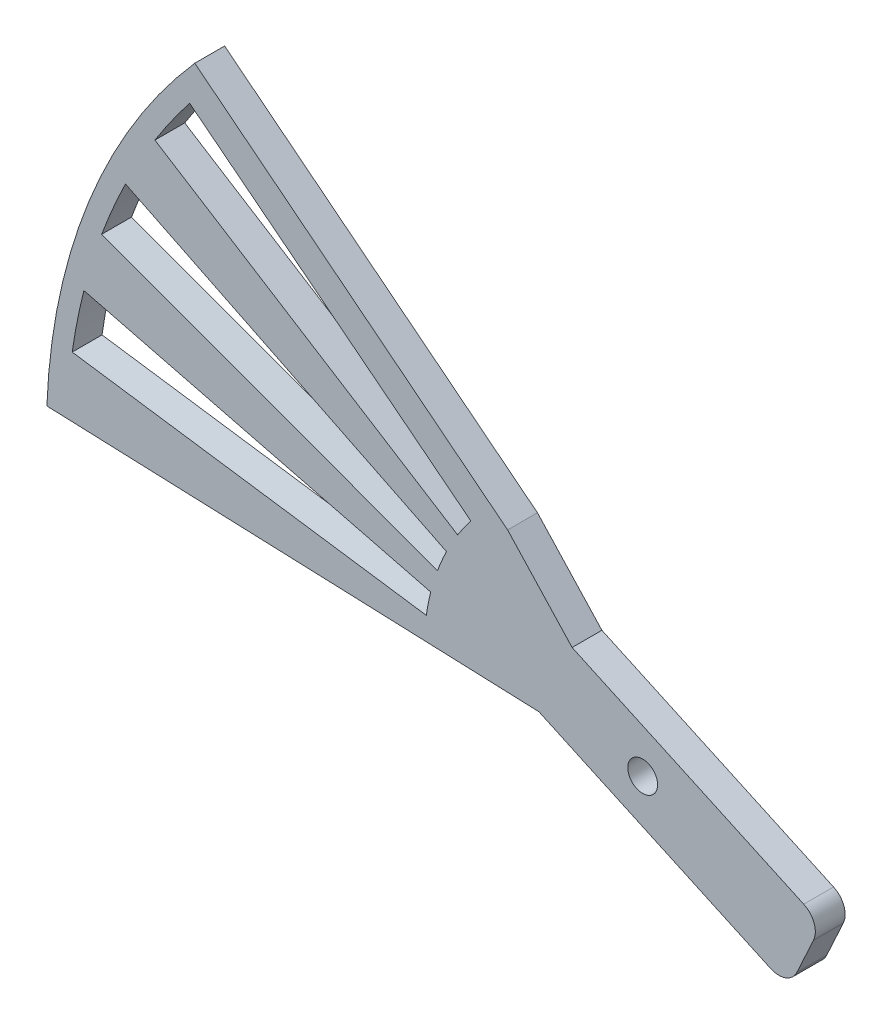
ISO-10303-21;
HEADER;
FILE_DESCRIPTION(('STEP AP214'),'2;1');
FILE_NAME('part.step','',(''),(''),'','','');
FILE_SCHEMA(('AUTOMOTIVE_DESIGN { 1 0 10303 214 1 1 1 1 }'));
ENDSEC;
DATA;
#1=APPLICATION_CONTEXT('core data for automotive mechanical design processes');
#2=APPLICATION_PROTOCOL_DEFINITION('international standard','automotive_design',2000,#1);
#3=PRODUCT_CONTEXT('',#1,'mechanical');
#4=PRODUCT('Part','Part','',(#3));
#5=PRODUCT_RELATED_PRODUCT_CATEGORY('part','',(#4));
#6=PRODUCT_DEFINITION_FORMATION('','',#4);
#7=PRODUCT_DEFINITION_CONTEXT('part definition',#1,'design');
#8=PRODUCT_DEFINITION('design','',#6,#7);
#9=PRODUCT_DEFINITION_SHAPE('','',#8);
#10=(LENGTH_UNIT() NAMED_UNIT(*) SI_UNIT(.MILLI.,.METRE.));
#11=(NAMED_UNIT(*) PLANE_ANGLE_UNIT() SI_UNIT($,.RADIAN.));
#12=(NAMED_UNIT(*) SI_UNIT($,.STERADIAN.) SOLID_ANGLE_UNIT());
#13=UNCERTAINTY_MEASURE_WITH_UNIT(LENGTH_MEASURE(1.E-05),#10,'distance_accuracy_value','');
#14=(GEOMETRIC_REPRESENTATION_CONTEXT(3) GLOBAL_UNCERTAINTY_ASSIGNED_CONTEXT((#13)) GLOBAL_UNIT_ASSIGNED_CONTEXT((#10,
#11,#12)) REPRESENTATION_CONTEXT('',''));
#15=CARTESIAN_POINT('',(0.,0.,0.));
#16=DIRECTION('',(0.,0.,1.));
#17=DIRECTION('',(1.,0.,0.));
#18=AXIS2_PLACEMENT_3D('',#15,#16,#17);
#19=CARTESIAN_POINT('',(-13.592462365831,14.671229220262,3.));
#20=DIRECTION('',(-0.620836450086055,-0.783940113940182,0.));
#21=DIRECTION('',(0.783940113940182,-0.620836450086055,0.));
#22=AXIS2_PLACEMENT_3D('',#19,#20,#21);
#23=PLANE('',#22);
#24=DIRECTION('',(-0.783940113940182,0.620836450086055,0.));
#25=VECTOR('',#24,1.);
#26=CARTESIAN_POINT('',(-13.592462365831,14.671229220262,0.));
#27=LINE('',#26,#25);
#28=CARTESIAN_POINT('',(-13.592462365831,14.671229220262,0.));
#29=VERTEX_POINT('',#28);
#30=CARTESIAN_POINT('',(-45.0736727010104,39.6025760430074,0.));
#31=VERTEX_POINT('',#30);
#32=EDGE_CURVE('E370',#29,#31,#27,.T.);
#33=ORIENTED_EDGE('',*,*,#32,.T.);
#34=DIRECTION('',(0.,0.,-1.));
#35=VECTOR('',#34,1.);
#36=CARTESIAN_POINT('',(-45.0736727010104,39.6025760430074,3.));
#37=LINE('',#36,#35);
#38=CARTESIAN_POINT('',(-45.0736727010104,39.6025760430074,3.));
#39=VERTEX_POINT('',#38);
#40=EDGE_CURVE('E391',#39,#31,#37,.T.);
#41=ORIENTED_EDGE('',*,*,#40,.F.);
#42=DIRECTION('',(-0.783940113940182,0.620836450086055,0.));
#43=VECTOR('',#42,1.);
#44=CARTESIAN_POINT('',(-13.592462365831,14.671229220262,3.));
#45=LINE('',#44,#43);
#46=CARTESIAN_POINT('',(-13.592462365831,14.671229220262,3.));
#47=VERTEX_POINT('',#46);
#48=EDGE_CURVE('E373',#47,#39,#45,.T.);
#49=ORIENTED_EDGE('',*,*,#48,.F.);
#50=DIRECTION('',(0.,0.,-1.));
#51=VECTOR('',#50,1.);
#52=CARTESIAN_POINT('',(-13.592462365831,14.671229220262,3.));
#53=LINE('',#52,#51);
#54=EDGE_CURVE('E386',#47,#29,#53,.T.);
#55=ORIENTED_EDGE('',*,*,#54,.T.);
#56=EDGE_LOOP('',(#33,#41,#49,#55));
#57=FACE_BOUND('',#56,.T.);
#58=ADVANCED_FACE('F42',(#57),#23,.F.);
#59=CARTESIAN_POINT('',(0.,0.,3.));
#60=DIRECTION('',(0.,0.,-1.));
#61=DIRECTION('',(-1.,0.,0.));
#62=AXIS2_PLACEMENT_3D('',#59,#60,#61);
#63=CYLINDRICAL_SURFACE('',#62,60.);
#64=CARTESIAN_POINT('',(0.,0.,0.));
#65=DIRECTION('',(0.,0.,1.));
#66=DIRECTION('',(1.,0.,0.));
#67=AXIS2_PLACEMENT_3D('',#64,#65,#66);
#68=CIRCLE('',#67,60.);
#69=CARTESIAN_POINT('',(-59.9563439456744,2.28841007426227,0.));
#70=VERTEX_POINT('',#69);
#71=EDGE_CURVE('E380',#31,#70,#68,.T.);
#72=ORIENTED_EDGE('',*,*,#71,.T.);
#73=DIRECTION('',(0.,0.,-1.));
#74=VECTOR('',#73,1.);
#75=CARTESIAN_POINT('',(-59.9563439456744,2.28841007426227,3.));
#76=LINE('',#75,#74);
#77=CARTESIAN_POINT('',(-59.9563439456744,2.28841007426227,3.));
#78=VERTEX_POINT('',#77);
#79=EDGE_CURVE('E376',#78,#70,#76,.T.);
#80=ORIENTED_EDGE('',*,*,#79,.F.);
#81=CARTESIAN_POINT('',(0.,0.,3.));
#82=DIRECTION('',(0.,0.,1.));
#83=DIRECTION('',(1.,0.,0.));
#84=AXIS2_PLACEMENT_3D('',#81,#82,#83);
#85=CIRCLE('',#84,60.);
#86=EDGE_CURVE('E369',#39,#78,#85,.T.);
#87=ORIENTED_EDGE('',*,*,#86,.F.);
#88=ORIENTED_EDGE('',*,*,#40,.T.);
#89=EDGE_LOOP('',(#72,#80,#87,#88));
#90=FACE_BOUND('',#89,.T.);
#91=ADVANCED_FACE('F451',(#90),#63,.T.);
#92=CARTESIAN_POINT('',(-19.9854479818915,0.762803358087425,3.));
#93=DIRECTION('',(-0.0381401679043713,-0.999272399094574,0.));
#94=DIRECTION('',(0.999272399094575,-0.0381401679043713,0.));
#95=AXIS2_PLACEMENT_3D('',#92,#93,#94);
#96=PLANE('',#95);
#97=DIRECTION('',(-0.999272399094574,0.0381401679043713,0.));
#98=VECTOR('',#97,1.);
#99=CARTESIAN_POINT('',(-19.9854479818915,0.762803358087425,0.));
#100=LINE('',#99,#98);
#101=CARTESIAN_POINT('',(-10.4448984678413,0.39866024686416,0.));
#102=VERTEX_POINT('',#101);
#103=EDGE_CURVE('E364',#102,#70,#100,.T.);
#104=ORIENTED_EDGE('',*,*,#103,.F.);
#105=DIRECTION('',(0.,0.,-1.));
#106=VECTOR('',#105,1.);
#107=CARTESIAN_POINT('',(-10.4448984678413,0.39866024686416,3.));
#108=LINE('',#107,#106);
#109=CARTESIAN_POINT('',(-10.4448984678413,0.39866024686416,3.));
#110=VERTEX_POINT('',#109);
#111=EDGE_CURVE('E360',#110,#102,#108,.T.);
#112=ORIENTED_EDGE('',*,*,#111,.F.);
#113=DIRECTION('',(-0.999272399094574,0.0381401679043713,0.));
#114=VECTOR('',#113,1.);
#115=CARTESIAN_POINT('',(-19.9854479818915,0.762803358087425,3.));
#116=LINE('',#115,#114);
#117=EDGE_CURVE('E365',#110,#78,#116,.T.);
#118=ORIENTED_EDGE('',*,*,#117,.T.);
#119=ORIENTED_EDGE('',*,*,#79,.T.);
#120=EDGE_LOOP('',(#104,#112,#118,#119));
#121=FACE_BOUND('',#120,.T.);
#122=ADVANCED_FACE('F446',(#121),#96,.T.);
#123=CARTESIAN_POINT('',(0.,0.,3.));
#124=DIRECTION('',(0.,0.,1.));
#125=DIRECTION('',(1.,0.,0.));
#126=AXIS2_PLACEMENT_3D('',#123,#124,#125);
#127=PLANE('',#126);
#128=CARTESIAN_POINT('',(0.,0.,3.));
#129=DIRECTION('',(0.,0.,-1.));
#130=DIRECTION('',(1.,0.,0.));
#131=AXIS2_PLACEMENT_3D('',#128,#129,#130);
#132=CIRCLE('',#131,22.);
#133=CARTESIAN_POINT('',(-20.6487284665645,7.59144338805803,3.));
#134=VERTEX_POINT('',#133);
#135=CARTESIAN_POINT('',(-19.7420906601754,9.70823652191346,3.));
#136=VERTEX_POINT('',#135);
#137=EDGE_CURVE('E58',#134,#136,#132,.T.);
#138=ORIENTED_EDGE('',*,*,#137,.F.);
#139=DIRECTION('',(0.938578566662022,-0.345065608548091,0.));
#140=VECTOR('',#139,1.);
#141=CARTESIAN_POINT('',(-54.4375568663973,20.0138052957893,3.));
#142=LINE('',#141,#140);
#143=CARTESIAN_POINT('',(-54.4375568663973,20.0138052957893,3.));
#144=VERTEX_POINT('',#143);
#145=EDGE_CURVE('E256',#144,#134,#142,.T.);
#146=ORIENTED_EDGE('',*,*,#145,.F.);
#147=CARTESIAN_POINT('',(0.,0.,3.));
#148=DIRECTION('',(0.,0.,1.));
#149=DIRECTION('',(1.,0.,0.));
#150=AXIS2_PLACEMENT_3D('',#147,#148,#149);
#151=CIRCLE('',#150,58.);
#152=CARTESIAN_POINT('',(-52.0473299222807,25.59444173959,3.));
#153=VERTEX_POINT('',#152);
#154=EDGE_CURVE('E252',#153,#144,#151,.T.);
#155=ORIENTED_EDGE('',*,*,#154,.F.);
#156=DIRECTION('',(-0.897367757280701,0.441283478268794,0.));
#157=VECTOR('',#156,1.);
#158=CARTESIAN_POINT('',(-52.0473299222807,25.59444173959,3.));
#159=LINE('',#158,#157);
#160=EDGE_CURVE('E248',#136,#153,#159,.T.);
#161=ORIENTED_EDGE('',*,*,#160,.F.);
#162=EDGE_LOOP('',(#138,#146,#155,#161));
#163=FACE_BOUND('',#162,.T.);
#164=CARTESIAN_POINT('',(0.,0.,3.));
#165=DIRECTION('',(0.,0.,-1.));
#166=DIRECTION('',(1.,0.,0.));
#167=AXIS2_PLACEMENT_3D('',#164,#165,#166);
#168=CIRCLE('',#167,22.);
#169=CARTESIAN_POINT('',(-18.6191543772154,11.7186641848557,3.));
#170=VERTEX_POINT('',#169);
#171=CARTESIAN_POINT('',(-17.2922227425901,13.6006997107005,3.));
#172=VERTEX_POINT('',#171);
#173=EDGE_CURVE('E66',#170,#172,#168,.T.);
#174=ORIENTED_EDGE('',*,*,#173,.F.);
#175=DIRECTION('',(0.846325198964338,-0.532666553857077,0.));
#176=VECTOR('',#175,1.);
#177=CARTESIAN_POINT('',(-49.0868615399316,30.8946601237104,3.));
#178=LINE('',#177,#176);
#179=CARTESIAN_POINT('',(-49.0868615399316,30.8946601237104,3.));
#180=VERTEX_POINT('',#179);
#181=EDGE_CURVE('E194',#180,#170,#178,.T.);
#182=ORIENTED_EDGE('',*,*,#181,.F.);
#183=CARTESIAN_POINT('',(0.,0.,3.));
#184=DIRECTION('',(0.,0.,1.));
#185=DIRECTION('',(1.,0.,0.));
#186=AXIS2_PLACEMENT_3D('',#183,#184,#185);
#187=CIRCLE('',#186,58.);
#188=CARTESIAN_POINT('',(-45.5885872304648,35.8563901463923,3.));
#189=VERTEX_POINT('',#188);
#190=EDGE_CURVE('E222',#189,#180,#187,.T.);
#191=ORIENTED_EDGE('',*,*,#190,.F.);
#192=DIRECTION('',(-0.786010124663187,0.618213623213661,0.));
#193=VECTOR('',#192,1.);
#194=CARTESIAN_POINT('',(-45.5885872304648,35.8563901463923,3.));
#195=LINE('',#194,#193);
#196=EDGE_CURVE('E214',#172,#189,#195,.T.);
#197=ORIENTED_EDGE('',*,*,#196,.F.);
#198=EDGE_LOOP('',(#174,#182,#191,#197));
#199=FACE_BOUND('',#198,.T.);
#200=CARTESIAN_POINT('',(0.,0.,3.));
#201=DIRECTION('',(0.,0.,-1.));
#202=DIRECTION('',(1.,0.,0.));
#203=AXIS2_PLACEMENT_3D('',#200,#201,#202);
#204=CIRCLE('',#203,22.);
#205=CARTESIAN_POINT('',(-21.7758540383323,3.13244008741524,3.));
#206=VERTEX_POINT('',#205);
#207=CARTESIAN_POINT('',(-21.3291344828496,5.39147681183138,3.));
#208=VERTEX_POINT('',#207);
#209=EDGE_CURVE('E287',#206,#208,#204,.T.);
#210=ORIENTED_EDGE('',*,*,#209,.F.);
#211=DIRECTION('',(0.989811547196924,-0.142383640337056,0.));
#212=VECTOR('',#211,1.);
#213=CARTESIAN_POINT('',(-57.4090697374216,8.25825113954926,3.));
#214=LINE('',#213,#212);
#215=CARTESIAN_POINT('',(-57.4090697374216,8.25825113954926,3.));
#216=VERTEX_POINT('',#215);
#217=EDGE_CURVE('E298',#216,#206,#214,.T.);
#218=ORIENTED_EDGE('',*,*,#217,.F.);
#219=CARTESIAN_POINT('',(0.,0.,3.));
#220=DIRECTION('',(0.,0.,1.));
#221=DIRECTION('',(1.,0.,0.));
#222=AXIS2_PLACEMENT_3D('',#219,#220,#221);
#223=CIRCLE('',#222,58.);
#224=CARTESIAN_POINT('',(-56.2313545456944,14.21389341301,3.));
#225=VERTEX_POINT('',#224);
#226=EDGE_CURVE('E294',#225,#216,#223,.T.);
#227=ORIENTED_EDGE('',*,*,#226,.F.);
#228=DIRECTION('',(-0.969506112856801,0.245067127810518,0.));
#229=VECTOR('',#228,1.);
#230=CARTESIAN_POINT('',(-56.2313545456944,14.21389341301,3.));
#231=LINE('',#230,#229);
#232=EDGE_CURVE('E290',#208,#225,#231,.T.);
#233=ORIENTED_EDGE('',*,*,#232,.F.);
#234=EDGE_LOOP('',(#210,#218,#227,#233));
#235=FACE_BOUND('',#234,.T.);
#236=DIRECTION('',(0.417641912046599,0.908611706562304,0.));
#237=VECTOR('',#236,1.);
#238=CARTESIAN_POINT('',(16.3550107181215,-7.51755441683877,3.));
#239=LINE('',#238,#237);
#240=CARTESIAN_POINT('',(15.5197268940283,-9.33477782996336,3.));
#241=VERTEX_POINT('',#240);
#242=CARTESIAN_POINT('',(17.1902945422146,-5.70033100371419,3.));
#243=VERTEX_POINT('',#242);
#244=EDGE_CURVE('E332',#241,#243,#239,.T.);
#245=ORIENTED_EDGE('',*,*,#244,.T.);
#246=CARTESIAN_POINT('',(15.37307112909,-4.865047179621,3.));
#247=DIRECTION('',(0.,0.,1.));
#248=DIRECTION('',(1.,0.,0.));
#249=AXIS2_PLACEMENT_3D('',#246,#247,#248);
#250=CIRCLE('',#249,2.);
#251=CARTESIAN_POINT('',(16.2083549531832,-3.04782376649639,3.));
#252=VERTEX_POINT('',#251);
#253=EDGE_CURVE('E51',#243,#252,#250,.T.);
#254=ORIENTED_EDGE('',*,*,#253,.T.);
#255=DIRECTION('',(0.908611706562304,-0.417641912046599,0.));
#256=VECTOR('',#255,1.);
#257=CARTESIAN_POINT('',(1.67056764818638,3.63444682624919,3.));
#258=LINE('',#257,#256);
#259=CARTESIAN_POINT('',(-7.1037631714681,7.6675538993624,3.));
#260=VERTEX_POINT('',#259);
#261=EDGE_CURVE('E336',#260,#252,#258,.T.);
#262=ORIENTED_EDGE('',*,*,#261,.F.);
#263=DIRECTION('',(-0.679623118291548,0.733561461013099,0.));
#264=VECTOR('',#263,1.);
#265=CARTESIAN_POINT('',(0.,0.,3.));
#266=LINE('',#265,#264);
#267=EDGE_CURVE('E324',#260,#47,#266,.T.);
#268=ORIENTED_EDGE('',*,*,#267,.T.);
#269=ORIENTED_EDGE('',*,*,#48,.T.);
#270=ORIENTED_EDGE('',*,*,#86,.T.);
#271=ORIENTED_EDGE('',*,*,#117,.F.);
#272=DIRECTION('',(0.908611706562304,-0.417641912046597,0.));
#273=VECTOR('',#272,1.);
#274=CARTESIAN_POINT('',(-1.67056764818639,-3.63444682624923,3.));
#275=LINE('',#274,#273);
#276=CARTESIAN_POINT('',(12.8672196568105,-10.3167174189948,3.));
#277=VERTEX_POINT('',#276);
#278=EDGE_CURVE('E328',#110,#277,#275,.T.);
#279=ORIENTED_EDGE('',*,*,#278,.T.);
#280=CARTESIAN_POINT('',(13.7025034809037,-8.49949400587017,3.));
#281=DIRECTION('',(0.,0.,1.));
#282=DIRECTION('',(1.,0.,0.));
#283=AXIS2_PLACEMENT_3D('',#280,#281,#282);
#284=CIRCLE('',#283,2.);
#285=EDGE_CURVE('E413',#277,#241,#284,.T.);
#286=ORIENTED_EDGE('',*,*,#285,.T.);
#287=EDGE_LOOP('',(#245,#254,#262,#268,#269,#270,#271,#279,#286));
#288=FACE_BOUND('',#287,.T.);
#289=CARTESIAN_POINT('',(0.,0.,3.));
#290=DIRECTION('',(0.,0.,1.));
#291=DIRECTION('',(1.,0.,0.));
#292=AXIS2_PLACEMENT_3D('',#289,#290,#291);
#293=CIRCLE('',#292,1.5);
#294=CARTESIAN_POINT('',(1.5,0.,3.));
#295=VERTEX_POINT('',#294);
#296=EDGE_CURVE('E320',#295,#295,#293,.T.);
#297=ORIENTED_EDGE('',*,*,#296,.F.);
#298=EDGE_LOOP('',(#297));
#299=FACE_BOUND('',#298,.T.);
#300=ADVANCED_FACE('F419',(#163,#199,#235,#288,#299),#127,.T.);
#301=CARTESIAN_POINT('',(0.,0.,0.));
#302=DIRECTION('',(0.,0.,1.));
#303=DIRECTION('',(1.,0.,0.));
#304=AXIS2_PLACEMENT_3D('',#301,#302,#303);
#305=PLANE('',#304);
#306=DIRECTION('',(-0.938578566662022,0.345065608548091,0.));
#307=VECTOR('',#306,1.);
#308=CARTESIAN_POINT('',(-54.4375568663973,20.0138052957893,0.));
#309=LINE('',#308,#307);
#310=CARTESIAN_POINT('',(-20.6487284665645,7.59144338805803,0.));
#311=VERTEX_POINT('',#310);
#312=CARTESIAN_POINT('',(-54.4375568663973,20.0138052957893,0.));
#313=VERTEX_POINT('',#312);
#314=EDGE_CURVE('E238',#311,#313,#309,.T.);
#315=ORIENTED_EDGE('',*,*,#314,.F.);
#316=CARTESIAN_POINT('',(0.,0.,0.));
#317=DIRECTION('',(0.,0.,1.));
#318=DIRECTION('',(1.,0.,0.));
#319=AXIS2_PLACEMENT_3D('',#316,#317,#318);
#320=CIRCLE('',#319,22.);
#321=CARTESIAN_POINT('',(-19.7420906601754,9.70823652191346,0.));
#322=VERTEX_POINT('',#321);
#323=EDGE_CURVE('E242',#322,#311,#320,.T.);
#324=ORIENTED_EDGE('',*,*,#323,.F.);
#325=DIRECTION('',(0.897367757280701,-0.441283478268794,0.));
#326=VECTOR('',#325,1.);
#327=CARTESIAN_POINT('',(-52.0473299222807,25.59444173959,0.));
#328=LINE('',#327,#326);
#329=CARTESIAN_POINT('',(-52.0473299222807,25.59444173959,0.));
#330=VERTEX_POINT('',#329);
#331=EDGE_CURVE('E264',#330,#322,#328,.T.);
#332=ORIENTED_EDGE('',*,*,#331,.F.);
#333=CARTESIAN_POINT('',(0.,0.,0.));
#334=DIRECTION('',(0.,0.,1.));
#335=DIRECTION('',(1.,0.,0.));
#336=AXIS2_PLACEMENT_3D('',#333,#334,#335);
#337=CIRCLE('',#336,58.);
#338=EDGE_CURVE('E203',#313,#330,#337,.F.);
#339=ORIENTED_EDGE('',*,*,#338,.F.);
#340=EDGE_LOOP('',(#315,#324,#332,#339));
#341=FACE_BOUND('',#340,.T.);
#342=DIRECTION('',(-0.846325198964338,0.532666553857077,0.));
#343=VECTOR('',#342,1.);
#344=CARTESIAN_POINT('',(-49.0868615399316,30.8946601237104,0.));
#345=LINE('',#344,#343);
#346=CARTESIAN_POINT('',(-18.6191543772154,11.7186641848557,0.));
#347=VERTEX_POINT('',#346);
#348=CARTESIAN_POINT('',(-49.0868615399316,30.8946601237104,0.));
#349=VERTEX_POINT('',#348);
#350=EDGE_CURVE('E209',#347,#349,#345,.T.);
#351=ORIENTED_EDGE('',*,*,#350,.F.);
#352=CARTESIAN_POINT('',(0.,0.,0.));
#353=DIRECTION('',(0.,0.,1.));
#354=DIRECTION('',(1.,0.,0.));
#355=AXIS2_PLACEMENT_3D('',#352,#353,#354);
#356=CIRCLE('',#355,22.);
#357=CARTESIAN_POINT('',(-17.2922227425901,13.6006997107005,0.));
#358=VERTEX_POINT('',#357);
#359=EDGE_CURVE('E187',#358,#347,#356,.T.);
#360=ORIENTED_EDGE('',*,*,#359,.F.);
#361=DIRECTION('',(0.786010124663187,-0.618213623213661,0.));
#362=VECTOR('',#361,1.);
#363=CARTESIAN_POINT('',(-45.5885872304648,35.8563901463923,0.));
#364=LINE('',#363,#362);
#365=CARTESIAN_POINT('',(-45.5885872304648,35.8563901463923,0.));
#366=VERTEX_POINT('',#365);
#367=EDGE_CURVE('E198',#366,#358,#364,.T.);
#368=ORIENTED_EDGE('',*,*,#367,.F.);
#369=CARTESIAN_POINT('',(0.,0.,0.));
#370=DIRECTION('',(0.,0.,1.));
#371=DIRECTION('',(1.,0.,0.));
#372=AXIS2_PLACEMENT_3D('',#369,#370,#371);
#373=CIRCLE('',#372,58.);
#374=EDGE_CURVE('E216',#349,#366,#373,.F.);
#375=ORIENTED_EDGE('',*,*,#374,.F.);
#376=EDGE_LOOP('',(#351,#360,#368,#375));
#377=FACE_BOUND('',#376,.T.);
#378=DIRECTION('',(-0.989811547196924,0.142383640337056,0.));
#379=VECTOR('',#378,1.);
#380=CARTESIAN_POINT('',(-57.4090697374216,8.25825113954926,0.));
#381=LINE('',#380,#379);
#382=CARTESIAN_POINT('',(-21.7758540383323,3.13244008741524,0.));
#383=VERTEX_POINT('',#382);
#384=CARTESIAN_POINT('',(-57.4090697374216,8.25825113954926,0.));
#385=VERTEX_POINT('',#384);
#386=EDGE_CURVE('E279',#383,#385,#381,.T.);
#387=ORIENTED_EDGE('',*,*,#386,.F.);
#388=CARTESIAN_POINT('',(0.,0.,0.));
#389=DIRECTION('',(0.,0.,1.));
#390=DIRECTION('',(1.,0.,0.));
#391=AXIS2_PLACEMENT_3D('',#388,#389,#390);
#392=CIRCLE('',#391,22.);
#393=CARTESIAN_POINT('',(-21.3291344828496,5.39147681183138,0.));
#394=VERTEX_POINT('',#393);
#395=EDGE_CURVE('E283',#394,#383,#392,.T.);
#396=ORIENTED_EDGE('',*,*,#395,.F.);
#397=DIRECTION('',(0.969506112856801,-0.245067127810518,0.));
#398=VECTOR('',#397,1.);
#399=CARTESIAN_POINT('',(-56.2313545456944,14.21389341301,0.));
#400=LINE('',#399,#398);
#401=CARTESIAN_POINT('',(-56.2313545456944,14.21389341301,0.));
#402=VERTEX_POINT('',#401);
#403=EDGE_CURVE('E306',#402,#394,#400,.T.);
#404=ORIENTED_EDGE('',*,*,#403,.F.);
#405=CARTESIAN_POINT('',(0.,0.,0.));
#406=DIRECTION('',(0.,0.,1.));
#407=DIRECTION('',(1.,0.,0.));
#408=AXIS2_PLACEMENT_3D('',#405,#406,#407);
#409=CIRCLE('',#408,58.);
#410=EDGE_CURVE('E276',#385,#402,#409,.F.);
#411=ORIENTED_EDGE('',*,*,#410,.F.);
#412=EDGE_LOOP('',(#387,#396,#404,#411));
#413=FACE_BOUND('',#412,.T.);
#414=DIRECTION('',(0.908611706562304,-0.417641912046599,0.));
#415=VECTOR('',#414,1.);
#416=CARTESIAN_POINT('',(1.67056764818638,3.63444682624919,0.));
#417=LINE('',#416,#415);
#418=CARTESIAN_POINT('',(-7.1037631714681,7.6675538993624,0.));
#419=VERTEX_POINT('',#418);
#420=CARTESIAN_POINT('',(16.2083549531832,-3.04782376649639,0.));
#421=VERTEX_POINT('',#420);
#422=EDGE_CURVE('E325',#419,#421,#417,.T.);
#423=ORIENTED_EDGE('',*,*,#422,.T.);
#424=CARTESIAN_POINT('',(15.37307112909,-4.865047179621,0.));
#425=DIRECTION('',(0.,0.,1.));
#426=DIRECTION('',(1.,0.,0.));
#427=AXIS2_PLACEMENT_3D('',#424,#425,#426);
#428=CIRCLE('',#427,2.);
#429=CARTESIAN_POINT('',(17.1902945422146,-5.70033100371419,0.));
#430=VERTEX_POINT('',#429);
#431=EDGE_CURVE('E403',#421,#430,#428,.F.);
#432=ORIENTED_EDGE('',*,*,#431,.T.);
#433=DIRECTION('',(0.417641912046599,0.908611706562304,0.));
#434=VECTOR('',#433,1.);
#435=CARTESIAN_POINT('',(16.3550107181215,-7.51755441683877,0.));
#436=LINE('',#435,#434);
#437=CARTESIAN_POINT('',(15.5197268940283,-9.33477782996336,0.));
#438=VERTEX_POINT('',#437);
#439=EDGE_CURVE('E351',#438,#430,#436,.T.);
#440=ORIENTED_EDGE('',*,*,#439,.F.);
#441=CARTESIAN_POINT('',(13.7025034809037,-8.49949400587017,0.));
#442=DIRECTION('',(0.,0.,1.));
#443=DIRECTION('',(1.,0.,0.));
#444=AXIS2_PLACEMENT_3D('',#441,#442,#443);
#445=CIRCLE('',#444,2.);
#446=CARTESIAN_POINT('',(12.8672196568105,-10.3167174189948,0.));
#447=VERTEX_POINT('',#446);
#448=EDGE_CURVE('E400',#438,#447,#445,.F.);
#449=ORIENTED_EDGE('',*,*,#448,.T.);
#450=DIRECTION('',(0.908611706562304,-0.417641912046597,0.));
#451=VECTOR('',#450,1.);
#452=CARTESIAN_POINT('',(-1.67056764818639,-3.63444682624923,0.));
#453=LINE('',#452,#451);
#454=EDGE_CURVE('E347',#102,#447,#453,.T.);
#455=ORIENTED_EDGE('',*,*,#454,.F.);
#456=ORIENTED_EDGE('',*,*,#103,.T.);
#457=ORIENTED_EDGE('',*,*,#71,.F.);
#458=ORIENTED_EDGE('',*,*,#32,.F.);
#459=DIRECTION('',(-0.679623118291548,0.733561461013099,0.));
#460=VECTOR('',#459,1.);
#461=CARTESIAN_POINT('',(0.,0.,0.));
#462=LINE('',#461,#460);
#463=EDGE_CURVE('E344',#419,#29,#462,.T.);
#464=ORIENTED_EDGE('',*,*,#463,.F.);
#465=EDGE_LOOP('',(#423,#432,#440,#449,#455,#456,#457,#458,#464));
#466=FACE_BOUND('',#465,.T.);
#467=CARTESIAN_POINT('',(0.,0.,0.));
#468=DIRECTION('',(0.,0.,1.));
#469=DIRECTION('',(1.,0.,0.));
#470=AXIS2_PLACEMENT_3D('',#467,#468,#469);
#471=CIRCLE('',#470,1.5);
#472=CARTESIAN_POINT('',(1.5,0.,0.));
#473=VERTEX_POINT('',#472);
#474=EDGE_CURVE('E319',#473,#473,#471,.T.);
#475=ORIENTED_EDGE('',*,*,#474,.T.);
#476=EDGE_LOOP('',(#475));
#477=FACE_BOUND('',#476,.T.);
#478=ADVANCED_FACE('F206',(#341,#377,#413,#466,#477),#305,.F.);
#479=CARTESIAN_POINT('',(0.,0.,3.));
#480=DIRECTION('',(-0.733561461013099,-0.679623118291548,0.));
#481=DIRECTION('',(0.679623118291548,-0.733561461013099,0.));
#482=AXIS2_PLACEMENT_3D('',#479,#480,#481);
#483=PLANE('',#482);
#484=ORIENTED_EDGE('',*,*,#463,.T.);
#485=ORIENTED_EDGE('',*,*,#54,.F.);
#486=ORIENTED_EDGE('',*,*,#267,.F.);
#487=DIRECTION('',(0.,0.,-1.));
#488=VECTOR('',#487,1.);
#489=CARTESIAN_POINT('',(-7.1037631714681,7.6675538993624,3.));
#490=LINE('',#489,#488);
#491=EDGE_CURVE('E340',#260,#419,#490,.T.);
#492=ORIENTED_EDGE('',*,*,#491,.T.);
#493=EDGE_LOOP('',(#484,#485,#486,#492));
#494=FACE_BOUND('',#493,.T.);
#495=ADVANCED_FACE('F458',(#494),#483,.F.);
#496=CARTESIAN_POINT('',(-1.67056764818639,-3.63444682624923,3.));
#497=DIRECTION('',(0.417641912046596,0.908611706562304,0.));
#498=DIRECTION('',(-0.908611706562304,0.417641912046597,0.));
#499=AXIS2_PLACEMENT_3D('',#496,#497,#498);
#500=PLANE('',#499);
#501=ORIENTED_EDGE('',*,*,#454,.T.);
#502=DIRECTION('',(0.,0.,-1.));
#503=VECTOR('',#502,1.);
#504=CARTESIAN_POINT('',(12.8672196568105,-10.3167174189948,3.));
#505=LINE('',#504,#503);
#506=EDGE_CURVE('E11',#447,#277,#505,.F.);
#507=ORIENTED_EDGE('',*,*,#506,.T.);
#508=ORIENTED_EDGE('',*,*,#278,.F.);
#509=ORIENTED_EDGE('',*,*,#111,.T.);
#510=EDGE_LOOP('',(#501,#507,#508,#509));
#511=FACE_BOUND('',#510,.T.);
#512=ADVANCED_FACE('F442',(#511),#500,.F.);
#513=CARTESIAN_POINT('',(16.3550107181215,-7.51755441683877,3.));
#514=DIRECTION('',(-0.908611706562303,0.417641912046598,0.));
#515=DIRECTION('',(-0.417641912046599,-0.908611706562304,0.));
#516=AXIS2_PLACEMENT_3D('',#513,#514,#515);
#517=PLANE('',#516);
#518=ORIENTED_EDGE('',*,*,#439,.T.);
#519=DIRECTION('',(0.,0.,-1.));
#520=VECTOR('',#519,1.);
#521=CARTESIAN_POINT('',(17.1902945422146,-5.70033100371419,3.));
#522=LINE('',#521,#520);
#523=EDGE_CURVE('E410',#430,#243,#522,.F.);
#524=ORIENTED_EDGE('',*,*,#523,.T.);
#525=ORIENTED_EDGE('',*,*,#244,.F.);
#526=DIRECTION('',(0.,0.,-1.));
#527=VECTOR('',#526,1.);
#528=CARTESIAN_POINT('',(15.5197268940283,-9.33477782996336,3.));
#529=LINE('',#528,#527);
#530=EDGE_CURVE('E406',#241,#438,#529,.T.);
#531=ORIENTED_EDGE('',*,*,#530,.T.);
#532=EDGE_LOOP('',(#518,#524,#525,#531));
#533=FACE_BOUND('',#532,.T.);
#534=ADVANCED_FACE('F435',(#533),#517,.F.);
#535=CARTESIAN_POINT('',(0.,0.,3.));
#536=DIRECTION('',(0.,0.,-1.));
#537=DIRECTION('',(-1.,0.,0.));
#538=AXIS2_PLACEMENT_3D('',#535,#536,#537);
#539=CYLINDRICAL_SURFACE('',#538,1.5);
#540=ORIENTED_EDGE('',*,*,#296,.T.);
#541=EDGE_LOOP('',(#540));
#542=FACE_BOUND('',#541,.T.);
#543=ORIENTED_EDGE('',*,*,#474,.F.);
#544=EDGE_LOOP('',(#543));
#545=FACE_BOUND('',#544,.T.);
#546=ADVANCED_FACE('F485',(#542,#545),#539,.F.);
#547=CARTESIAN_POINT('',(1.67056764818638,3.63444682624919,3.));
#548=DIRECTION('',(0.417641912046599,0.908611706562303,0.));
#549=DIRECTION('',(-0.908611706562304,0.417641912046599,0.));
#550=AXIS2_PLACEMENT_3D('',#547,#548,#549);
#551=PLANE('',#550);
#552=ORIENTED_EDGE('',*,*,#261,.T.);
#553=DIRECTION('',(0.,0.,-1.));
#554=VECTOR('',#553,1.);
#555=CARTESIAN_POINT('',(16.2083549531832,-3.04782376649639,0.));
#556=LINE('',#555,#554);
#557=EDGE_CURVE('E390',#252,#421,#556,.T.);
#558=ORIENTED_EDGE('',*,*,#557,.T.);
#559=ORIENTED_EDGE('',*,*,#422,.F.);
#560=ORIENTED_EDGE('',*,*,#491,.F.);
#561=EDGE_LOOP('',(#552,#558,#559,#560));
#562=FACE_BOUND('',#561,.T.);
#563=ADVANCED_FACE('F426',(#562),#551,.T.);
#564=CARTESIAN_POINT('',(15.37307112909,-4.865047179621,3.));
#565=DIRECTION('',(0.,0.,1.));
#566=DIRECTION('',(1.,0.,0.));
#567=AXIS2_PLACEMENT_3D('',#564,#565,#566);
#568=CYLINDRICAL_SURFACE('',#567,2.);
#569=ORIENTED_EDGE('',*,*,#253,.F.);
#570=ORIENTED_EDGE('',*,*,#523,.F.);
#571=ORIENTED_EDGE('',*,*,#431,.F.);
#572=ORIENTED_EDGE('',*,*,#557,.F.);
#573=EDGE_LOOP('',(#569,#570,#571,#572));
#574=FACE_BOUND('',#573,.T.);
#575=ADVANCED_FACE('F429',(#574),#568,.T.);
#576=CARTESIAN_POINT('',(13.7025034809037,-8.49949400587017,3.));
#577=DIRECTION('',(0.,0.,-1.));
#578=DIRECTION('',(-1.,0.,0.));
#579=AXIS2_PLACEMENT_3D('',#576,#577,#578);
#580=CYLINDRICAL_SURFACE('',#579,2.);
#581=ORIENTED_EDGE('',*,*,#285,.F.);
#582=ORIENTED_EDGE('',*,*,#506,.F.);
#583=ORIENTED_EDGE('',*,*,#448,.F.);
#584=ORIENTED_EDGE('',*,*,#530,.F.);
#585=EDGE_LOOP('',(#581,#582,#583,#584));
#586=FACE_BOUND('',#585,.T.);
#587=ADVANCED_FACE('F44',(#586),#580,.T.);
#588=CARTESIAN_POINT('',(0.,0.,-0.00100000000000013));
#589=DIRECTION('',(0.,0.,1.));
#590=DIRECTION('',(1.,0.,0.));
#591=AXIS2_PLACEMENT_3D('',#588,#589,#590);
#592=CYLINDRICAL_SURFACE('',#591,22.);
#593=ORIENTED_EDGE('',*,*,#395,.T.);
#594=DIRECTION('',(0.,0.,1.));
#595=VECTOR('',#594,1.);
#596=CARTESIAN_POINT('',(-21.7758540383323,3.13244008741524,-0.00100000000000013));
#597=LINE('',#596,#595);
#598=EDGE_CURVE('E303',#383,#206,#597,.T.);
#599=ORIENTED_EDGE('',*,*,#598,.T.);
#600=ORIENTED_EDGE('',*,*,#209,.T.);
#601=DIRECTION('',(0.,0.,1.));
#602=VECTOR('',#601,1.);
#603=CARTESIAN_POINT('',(-21.3291344828496,5.39147681183139,-0.00100000000000013));
#604=LINE('',#603,#602);
#605=EDGE_CURVE('E302',#394,#208,#604,.T.);
#606=ORIENTED_EDGE('',*,*,#605,.F.);
#607=EDGE_LOOP('',(#593,#599,#600,#606));
#608=FACE_BOUND('',#607,.T.);
#609=ADVANCED_FACE('F484',(#608),#592,.T.);
#610=CARTESIAN_POINT('',(-57.4090697374216,8.25825113954926,-0.00100000000000013));
#611=DIRECTION('',(-0.142383640337056,-0.989811547196924,0.));
#612=DIRECTION('',(0.989811547196924,-0.142383640337056,0.));
#613=AXIS2_PLACEMENT_3D('',#610,#611,#612);
#614=PLANE('',#613);
#615=ORIENTED_EDGE('',*,*,#386,.T.);
#616=DIRECTION('',(0.,0.,1.));
#617=VECTOR('',#616,1.);
#618=CARTESIAN_POINT('',(-57.4090697374216,8.25825113954926,-0.00100000000000013));
#619=LINE('',#618,#617);
#620=EDGE_CURVE('E307',#385,#216,#619,.T.);
#621=ORIENTED_EDGE('',*,*,#620,.T.);
#622=ORIENTED_EDGE('',*,*,#217,.T.);
#623=ORIENTED_EDGE('',*,*,#598,.F.);
#624=EDGE_LOOP('',(#615,#621,#622,#623));
#625=FACE_BOUND('',#624,.T.);
#626=ADVANCED_FACE('F564',(#625),#614,.F.);
#627=CARTESIAN_POINT('',(0.,0.,-0.00100000000000013));
#628=DIRECTION('',(0.,0.,1.));
#629=DIRECTION('',(1.,0.,0.));
#630=AXIS2_PLACEMENT_3D('',#627,#628,#629);
#631=CYLINDRICAL_SURFACE('',#630,58.);
#632=ORIENTED_EDGE('',*,*,#410,.T.);
#633=DIRECTION('',(0.,0.,1.));
#634=VECTOR('',#633,1.);
#635=CARTESIAN_POINT('',(-56.2313545456944,14.21389341301,-0.00100000000000013));
#636=LINE('',#635,#634);
#637=EDGE_CURVE('E310',#402,#225,#636,.T.);
#638=ORIENTED_EDGE('',*,*,#637,.T.);
#639=ORIENTED_EDGE('',*,*,#226,.T.);
#640=ORIENTED_EDGE('',*,*,#620,.F.);
#641=EDGE_LOOP('',(#632,#638,#639,#640));
#642=FACE_BOUND('',#641,.T.);
#643=ADVANCED_FACE('F573',(#642),#631,.F.);
#644=CARTESIAN_POINT('',(-56.2313545456944,14.21389341301,-0.00100000000000013));
#645=DIRECTION('',(0.245067127810518,0.969506112856801,0.));
#646=DIRECTION('',(-0.969506112856801,0.245067127810518,0.));
#647=AXIS2_PLACEMENT_3D('',#644,#645,#646);
#648=PLANE('',#647);
#649=ORIENTED_EDGE('',*,*,#403,.T.);
#650=ORIENTED_EDGE('',*,*,#605,.T.);
#651=ORIENTED_EDGE('',*,*,#232,.T.);
#652=ORIENTED_EDGE('',*,*,#637,.F.);
#653=EDGE_LOOP('',(#649,#650,#651,#652));
#654=FACE_BOUND('',#653,.T.);
#655=ADVANCED_FACE('F583',(#654),#648,.F.);
#656=CARTESIAN_POINT('',(0.,0.,-0.00100000000000013));
#657=DIRECTION('',(0.,0.,1.));
#658=DIRECTION('',(1.,0.,0.));
#659=AXIS2_PLACEMENT_3D('',#656,#657,#658);
#660=CYLINDRICAL_SURFACE('',#659,22.);
#661=ORIENTED_EDGE('',*,*,#359,.T.);
#662=DIRECTION('',(0.,0.,1.));
#663=VECTOR('',#662,1.);
#664=CARTESIAN_POINT('',(-18.6191543772154,11.7186641848557,-0.00100000000000013));
#665=LINE('',#664,#663);
#666=EDGE_CURVE('E204',#347,#170,#665,.T.);
#667=ORIENTED_EDGE('',*,*,#666,.T.);
#668=ORIENTED_EDGE('',*,*,#173,.T.);
#669=DIRECTION('',(0.,0.,1.));
#670=VECTOR('',#669,1.);
#671=CARTESIAN_POINT('',(-17.2922227425901,13.6006997107005,-0.00100000000000013));
#672=LINE('',#671,#670);
#673=EDGE_CURVE('E183',#358,#172,#672,.T.);
#674=ORIENTED_EDGE('',*,*,#673,.F.);
#675=EDGE_LOOP('',(#661,#667,#668,#674));
#676=FACE_BOUND('',#675,.T.);
#677=ADVANCED_FACE('F185',(#676),#660,.T.);
#678=CARTESIAN_POINT('',(-49.0868615399316,30.8946601237104,-0.00100000000000013));
#679=DIRECTION('',(-0.532666553857077,-0.846325198964338,0.));
#680=DIRECTION('',(0.846325198964338,-0.532666553857077,0.));
#681=AXIS2_PLACEMENT_3D('',#678,#679,#680);
#682=PLANE('',#681);
#683=ORIENTED_EDGE('',*,*,#350,.T.);
#684=DIRECTION('',(0.,0.,1.));
#685=VECTOR('',#684,1.);
#686=CARTESIAN_POINT('',(-49.0868615399316,30.8946601237104,-0.00100000000000013));
#687=LINE('',#686,#685);
#688=EDGE_CURVE('E231',#349,#180,#687,.T.);
#689=ORIENTED_EDGE('',*,*,#688,.T.);
#690=ORIENTED_EDGE('',*,*,#181,.T.);
#691=ORIENTED_EDGE('',*,*,#666,.F.);
#692=EDGE_LOOP('',(#683,#689,#690,#691));
#693=FACE_BOUND('',#692,.T.);
#694=ADVANCED_FACE('F601',(#693),#682,.F.);
#695=CARTESIAN_POINT('',(0.,0.,-0.00100000000000013));
#696=DIRECTION('',(0.,0.,1.));
#697=DIRECTION('',(1.,0.,0.));
#698=AXIS2_PLACEMENT_3D('',#695,#696,#697);
#699=CYLINDRICAL_SURFACE('',#698,58.);
#700=ORIENTED_EDGE('',*,*,#374,.T.);
#701=DIRECTION('',(0.,0.,1.));
#702=VECTOR('',#701,1.);
#703=CARTESIAN_POINT('',(-45.5885872304648,35.8563901463923,-0.00100000000000013));
#704=LINE('',#703,#702);
#705=EDGE_CURVE('E193',#366,#189,#704,.T.);
#706=ORIENTED_EDGE('',*,*,#705,.T.);
#707=ORIENTED_EDGE('',*,*,#190,.T.);
#708=ORIENTED_EDGE('',*,*,#688,.F.);
#709=EDGE_LOOP('',(#700,#706,#707,#708));
#710=FACE_BOUND('',#709,.T.);
#711=ADVANCED_FACE('F610',(#710),#699,.F.);
#712=CARTESIAN_POINT('',(-45.5885872304648,35.8563901463923,-0.00100000000000013));
#713=DIRECTION('',(0.618213623213661,0.786010124663186,0.));
#714=DIRECTION('',(-0.786010124663187,0.618213623213661,0.));
#715=AXIS2_PLACEMENT_3D('',#712,#713,#714);
#716=PLANE('',#715);
#717=ORIENTED_EDGE('',*,*,#367,.T.);
#718=ORIENTED_EDGE('',*,*,#673,.T.);
#719=ORIENTED_EDGE('',*,*,#196,.T.);
#720=ORIENTED_EDGE('',*,*,#705,.F.);
#721=EDGE_LOOP('',(#717,#718,#719,#720));
#722=FACE_BOUND('',#721,.T.);
#723=ADVANCED_FACE('F199',(#722),#716,.F.);
#724=CARTESIAN_POINT('',(0.,0.,-0.00100000000000013));
#725=DIRECTION('',(0.,0.,1.));
#726=DIRECTION('',(1.,0.,0.));
#727=AXIS2_PLACEMENT_3D('',#724,#725,#726);
#728=CYLINDRICAL_SURFACE('',#727,22.);
#729=ORIENTED_EDGE('',*,*,#323,.T.);
#730=DIRECTION('',(0.,0.,1.));
#731=VECTOR('',#730,1.);
#732=CARTESIAN_POINT('',(-20.6487284665645,7.59144338805803,-0.00100000000000013));
#733=LINE('',#732,#731);
#734=EDGE_CURVE('E261',#311,#134,#733,.T.);
#735=ORIENTED_EDGE('',*,*,#734,.T.);
#736=ORIENTED_EDGE('',*,*,#137,.T.);
#737=DIRECTION('',(0.,0.,1.));
#738=VECTOR('',#737,1.);
#739=CARTESIAN_POINT('',(-19.7420906601754,9.70823652191346,-0.00100000000000013));
#740=LINE('',#739,#738);
#741=EDGE_CURVE('E260',#322,#136,#740,.T.);
#742=ORIENTED_EDGE('',*,*,#741,.F.);
#743=EDGE_LOOP('',(#729,#735,#736,#742));
#744=FACE_BOUND('',#743,.T.);
#745=ADVANCED_FACE('F629',(#744),#728,.T.);
#746=CARTESIAN_POINT('',(-54.4375568663973,20.0138052957893,-0.00100000000000013));
#747=DIRECTION('',(-0.345065608548091,-0.938578566662022,0.));
#748=DIRECTION('',(0.938578566662022,-0.345065608548091,0.));
#749=AXIS2_PLACEMENT_3D('',#746,#747,#748);
#750=PLANE('',#749);
#751=ORIENTED_EDGE('',*,*,#314,.T.);
#752=DIRECTION('',(0.,0.,1.));
#753=VECTOR('',#752,1.);
#754=CARTESIAN_POINT('',(-54.4375568663973,20.0138052957893,-0.00100000000000013));
#755=LINE('',#754,#753);
#756=EDGE_CURVE('E265',#313,#144,#755,.T.);
#757=ORIENTED_EDGE('',*,*,#756,.T.);
#758=ORIENTED_EDGE('',*,*,#145,.T.);
#759=ORIENTED_EDGE('',*,*,#734,.F.);
#760=EDGE_LOOP('',(#751,#757,#758,#759));
#761=FACE_BOUND('',#760,.T.);
#762=ADVANCED_FACE('F638',(#761),#750,.F.);
#763=CARTESIAN_POINT('',(0.,0.,-0.00100000000000013));
#764=DIRECTION('',(0.,0.,1.));
#765=DIRECTION('',(1.,0.,0.));
#766=AXIS2_PLACEMENT_3D('',#763,#764,#765);
#767=CYLINDRICAL_SURFACE('',#766,58.);
#768=ORIENTED_EDGE('',*,*,#338,.T.);
#769=DIRECTION('',(0.,0.,1.));
#770=VECTOR('',#769,1.);
#771=CARTESIAN_POINT('',(-52.0473299222807,25.59444173959,-0.00100000000000013));
#772=LINE('',#771,#770);
#773=EDGE_CURVE('E268',#330,#153,#772,.T.);
#774=ORIENTED_EDGE('',*,*,#773,.T.);
#775=ORIENTED_EDGE('',*,*,#154,.T.);
#776=ORIENTED_EDGE('',*,*,#756,.F.);
#777=EDGE_LOOP('',(#768,#774,#775,#776));
#778=FACE_BOUND('',#777,.T.);
#779=ADVANCED_FACE('F647',(#778),#767,.F.);
#780=CARTESIAN_POINT('',(-52.0473299222807,25.59444173959,-0.00100000000000013));
#781=DIRECTION('',(0.441283478268794,0.897367757280701,0.));
#782=DIRECTION('',(-0.897367757280701,0.441283478268794,0.));
#783=AXIS2_PLACEMENT_3D('',#780,#781,#782);
#784=PLANE('',#783);
#785=ORIENTED_EDGE('',*,*,#331,.T.);
#786=ORIENTED_EDGE('',*,*,#741,.T.);
#787=ORIENTED_EDGE('',*,*,#160,.T.);
#788=ORIENTED_EDGE('',*,*,#773,.F.);
#789=EDGE_LOOP('',(#785,#786,#787,#788));
#790=FACE_BOUND('',#789,.T.);
#791=ADVANCED_FACE('F657',(#790),#784,.F.);
#792=CLOSED_SHELL('',(#58,#91,#122,#300,#478,#495,#512,#534,#546,#563,#575,#587,#609,#626,#643,
#655,#677,#694,#711,#723,#745,#762,#779,#791));
#793=MANIFOLD_SOLID_BREP('B2',#792);
#794=ADVANCED_BREP_SHAPE_REPRESENTATION('',(#18,#793),#14);
#795=SHAPE_DEFINITION_REPRESENTATION(#9,#794);
ENDSEC;
END-ISO-10303-21;
